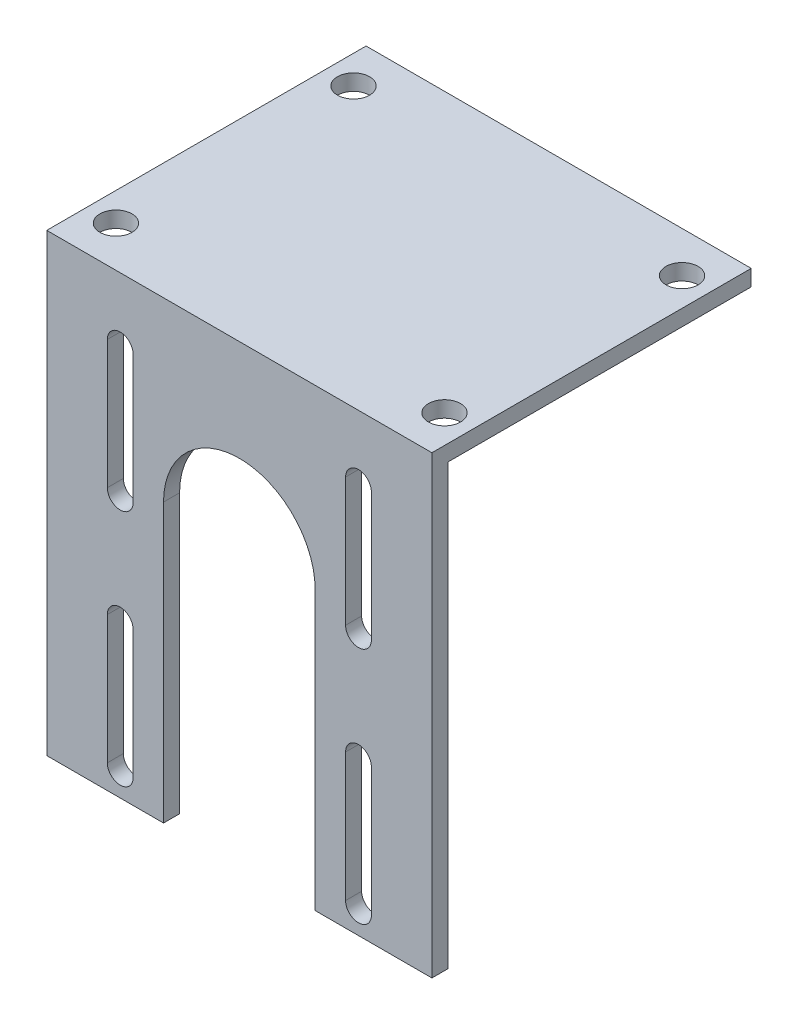
ISO-10303-21;
HEADER;
FILE_DESCRIPTION(('STEP AP214'),'2;1');
FILE_NAME('part.step','',(''),(''),'','','');
FILE_SCHEMA(('AUTOMOTIVE_DESIGN { 1 0 10303 214 1 1 1 1 }'));
ENDSEC;
DATA;
#1=APPLICATION_CONTEXT('core data for automotive mechanical design processes');
#2=APPLICATION_PROTOCOL_DEFINITION('international standard','automotive_design',2000,#1);
#3=PRODUCT_CONTEXT('',#1,'mechanical');
#4=PRODUCT('Part','Part','',(#3));
#5=PRODUCT_RELATED_PRODUCT_CATEGORY('part','',(#4));
#6=PRODUCT_DEFINITION_FORMATION('','',#4);
#7=PRODUCT_DEFINITION_CONTEXT('part definition',#1,'design');
#8=PRODUCT_DEFINITION('design','',#6,#7);
#9=PRODUCT_DEFINITION_SHAPE('','',#8);
#10=(LENGTH_UNIT() NAMED_UNIT(*) SI_UNIT(.MILLI.,.METRE.));
#11=(NAMED_UNIT(*) PLANE_ANGLE_UNIT() SI_UNIT($,.RADIAN.));
#12=(NAMED_UNIT(*) SI_UNIT($,.STERADIAN.) SOLID_ANGLE_UNIT());
#13=UNCERTAINTY_MEASURE_WITH_UNIT(LENGTH_MEASURE(1.E-05),#10,'distance_accuracy_value','');
#14=(GEOMETRIC_REPRESENTATION_CONTEXT(3) GLOBAL_UNCERTAINTY_ASSIGNED_CONTEXT((#13)) GLOBAL_UNIT_ASSIGNED_CONTEXT((#10,
#11,#12)) REPRESENTATION_CONTEXT('',''));
#15=CARTESIAN_POINT('',(0.,0.,0.));
#16=DIRECTION('',(0.,0.,1.));
#17=DIRECTION('',(1.,0.,0.));
#18=AXIS2_PLACEMENT_3D('',#15,#16,#17);
#19=CARTESIAN_POINT('',(0.,0.,3.175));
#20=DIRECTION('',(0.,0.,-1.));
#21=DIRECTION('',(-1.,0.,0.));
#22=AXIS2_PLACEMENT_3D('',#19,#20,#21);
#23=PLANE('',#22);
#24=CARTESIAN_POINT('',(14.53,-85.24,3.175));
#25=DIRECTION('',(0.,0.,1.));
#26=DIRECTION('',(-1.,0.,0.));
#27=AXIS2_PLACEMENT_3D('',#24,#25,#26);
#28=CIRCLE('',#27,2.54999999999998);
#29=CARTESIAN_POINT('',(11.98,-85.24,3.175));
#30=VERTEX_POINT('',#29);
#31=CARTESIAN_POINT('',(17.08,-85.24,3.175));
#32=VERTEX_POINT('',#31);
#33=EDGE_CURVE('E366',#30,#32,#28,.T.);
#34=ORIENTED_EDGE('',*,*,#33,.F.);
#35=DIRECTION('',(0.,-1.,0.));
#36=VECTOR('',#35,1.);
#37=CARTESIAN_POINT('',(11.98,-85.24,3.175));
#38=LINE('',#37,#36);
#39=CARTESIAN_POINT('',(11.98,-59.84,3.175));
#40=VERTEX_POINT('',#39);
#41=EDGE_CURVE('E377',#40,#30,#38,.T.);
#42=ORIENTED_EDGE('',*,*,#41,.F.);
#43=CARTESIAN_POINT('',(14.53,-59.84,3.175));
#44=DIRECTION('',(0.,0.,1.));
#45=DIRECTION('',(-1.,0.,0.));
#46=AXIS2_PLACEMENT_3D('',#43,#44,#45);
#47=CIRCLE('',#46,2.54999999999998);
#48=CARTESIAN_POINT('',(17.08,-59.84,3.175));
#49=VERTEX_POINT('',#48);
#50=EDGE_CURVE('E373',#49,#40,#47,.T.);
#51=ORIENTED_EDGE('',*,*,#50,.F.);
#52=DIRECTION('',(0.,1.,0.));
#53=VECTOR('',#52,1.);
#54=CARTESIAN_POINT('',(17.08,-85.24,3.175));
#55=LINE('',#54,#53);
#56=EDGE_CURVE('E369',#32,#49,#55,.T.);
#57=ORIENTED_EDGE('',*,*,#56,.F.);
#58=EDGE_LOOP('',(#34,#42,#51,#57));
#59=FACE_BOUND('',#58,.T.);
#60=CARTESIAN_POINT('',(14.53,-12.7,3.175));
#61=DIRECTION('',(0.,0.,1.));
#62=DIRECTION('',(1.,0.,0.));
#63=AXIS2_PLACEMENT_3D('',#60,#61,#62);
#64=CIRCLE('',#63,2.55000000000001);
#65=CARTESIAN_POINT('',(17.08,-12.7,3.175));
#66=VERTEX_POINT('',#65);
#67=CARTESIAN_POINT('',(11.98,-12.7,3.175));
#68=VERTEX_POINT('',#67);
#69=EDGE_CURVE('E452',#66,#68,#64,.T.);
#70=ORIENTED_EDGE('',*,*,#69,.F.);
#71=DIRECTION('',(0.,1.,0.));
#72=VECTOR('',#71,1.);
#73=CARTESIAN_POINT('',(17.08,-12.7,3.175));
#74=LINE('',#73,#72);
#75=CARTESIAN_POINT('',(17.08,-38.1,3.175));
#76=VERTEX_POINT('',#75);
#77=EDGE_CURVE('E463',#76,#66,#74,.T.);
#78=ORIENTED_EDGE('',*,*,#77,.F.);
#79=CARTESIAN_POINT('',(14.53,-38.1,3.175));
#80=DIRECTION('',(0.,0.,1.));
#81=DIRECTION('',(1.,0.,0.));
#82=AXIS2_PLACEMENT_3D('',#79,#80,#81);
#83=CIRCLE('',#82,2.55000000000001);
#84=CARTESIAN_POINT('',(11.98,-38.1,3.175));
#85=VERTEX_POINT('',#84);
#86=EDGE_CURVE('E459',#85,#76,#83,.T.);
#87=ORIENTED_EDGE('',*,*,#86,.F.);
#88=DIRECTION('',(0.,-1.,0.));
#89=VECTOR('',#88,1.);
#90=CARTESIAN_POINT('',(11.98,-12.7,3.175));
#91=LINE('',#90,#89);
#92=EDGE_CURVE('E455',#68,#85,#91,.T.);
#93=ORIENTED_EDGE('',*,*,#92,.F.);
#94=EDGE_LOOP('',(#70,#78,#87,#93));
#95=FACE_BOUND('',#94,.T.);
#96=DIRECTION('',(0.,-1.,0.));
#97=VECTOR('',#96,1.);
#98=CARTESIAN_POINT('',(0.,0.,3.175));
#99=LINE('',#98,#97);
#100=CARTESIAN_POINT('',(0.,0.,3.175));
#101=VERTEX_POINT('',#100);
#102=CARTESIAN_POINT('',(0.,-90.,3.175));
#103=VERTEX_POINT('',#102);
#104=EDGE_CURVE('E239',#101,#103,#99,.T.);
#105=ORIENTED_EDGE('',*,*,#104,.T.);
#106=DIRECTION('',(-1.,0.,0.));
#107=VECTOR('',#106,1.);
#108=CARTESIAN_POINT('',(0.,-90.,3.175));
#109=LINE('',#108,#107);
#110=CARTESIAN_POINT('',(23.1,-90.,3.175));
#111=VERTEX_POINT('',#110);
#112=EDGE_CURVE('E229',#111,#103,#109,.T.);
#113=ORIENTED_EDGE('',*,*,#112,.F.);
#114=DIRECTION('',(0.,-1.,0.));
#115=VECTOR('',#114,1.);
#116=CARTESIAN_POINT('',(23.1,-35.0000000000001,3.175));
#117=LINE('',#116,#115);
#118=CARTESIAN_POINT('',(23.1,-35.0000000000001,3.175));
#119=VERTEX_POINT('',#118);
#120=EDGE_CURVE('E305',#119,#111,#117,.T.);
#121=ORIENTED_EDGE('',*,*,#120,.F.);
#122=CARTESIAN_POINT('',(38.1,-35.0000000000001,3.175));
#123=DIRECTION('',(0.,0.,1.));
#124=DIRECTION('',(-1.,0.,0.));
#125=AXIS2_PLACEMENT_3D('',#122,#123,#124);
#126=CIRCLE('',#125,15.);
#127=CARTESIAN_POINT('',(53.1,-35.0000000000001,3.175));
#128=VERTEX_POINT('',#127);
#129=EDGE_CURVE('E301',#128,#119,#126,.T.);
#130=ORIENTED_EDGE('',*,*,#129,.F.);
#131=DIRECTION('',(0.,1.,0.));
#132=VECTOR('',#131,1.);
#133=CARTESIAN_POINT('',(53.1,-35.0000000000001,3.175));
#134=LINE('',#133,#132);
#135=CARTESIAN_POINT('',(53.1,-90.,3.175));
#136=VERTEX_POINT('',#135);
#137=EDGE_CURVE('E227',#136,#128,#134,.T.);
#138=ORIENTED_EDGE('',*,*,#137,.F.);
#139=CARTESIAN_POINT('',(76.2,-90.,3.175));
#140=VERTEX_POINT('',#139);
#141=EDGE_CURVE('E55',#140,#136,#109,.T.);
#142=ORIENTED_EDGE('',*,*,#141,.F.);
#143=DIRECTION('',(0.,1.,0.));
#144=VECTOR('',#143,1.);
#145=CARTESIAN_POINT('',(76.2,-100.,3.175));
#146=LINE('',#145,#144);
#147=CARTESIAN_POINT('',(76.2,0.,3.175));
#148=VERTEX_POINT('',#147);
#149=EDGE_CURVE('E224',#140,#148,#146,.T.);
#150=ORIENTED_EDGE('',*,*,#149,.T.);
#151=DIRECTION('',(-1.,0.,0.));
#152=VECTOR('',#151,1.);
#153=CARTESIAN_POINT('',(0.,0.,3.175));
#154=LINE('',#153,#152);
#155=EDGE_CURVE('E234',#148,#101,#154,.T.);
#156=ORIENTED_EDGE('',*,*,#155,.T.);
#157=EDGE_LOOP('',(#105,#113,#121,#130,#138,#142,#150,#156));
#158=FACE_BOUND('',#157,.T.);
#159=CARTESIAN_POINT('',(61.67,-12.7,3.175));
#160=DIRECTION('',(0.,0.,1.));
#161=DIRECTION('',(-1.,0.,0.));
#162=AXIS2_PLACEMENT_3D('',#159,#160,#161);
#163=CIRCLE('',#162,2.55000000000001);
#164=CARTESIAN_POINT('',(64.22,-12.7,3.175));
#165=VERTEX_POINT('',#164);
#166=CARTESIAN_POINT('',(59.12,-12.7,3.175));
#167=VERTEX_POINT('',#166);
#168=EDGE_CURVE('E409',#165,#167,#163,.T.);
#169=ORIENTED_EDGE('',*,*,#168,.F.);
#170=DIRECTION('',(0.,1.,0.));
#171=VECTOR('',#170,1.);
#172=CARTESIAN_POINT('',(64.22,-12.7,3.175));
#173=LINE('',#172,#171);
#174=CARTESIAN_POINT('',(64.22,-38.1,3.175));
#175=VERTEX_POINT('',#174);
#176=EDGE_CURVE('E420',#175,#165,#173,.T.);
#177=ORIENTED_EDGE('',*,*,#176,.F.);
#178=CARTESIAN_POINT('',(61.67,-38.1,3.175));
#179=DIRECTION('',(0.,0.,1.));
#180=DIRECTION('',(-1.,0.,0.));
#181=AXIS2_PLACEMENT_3D('',#178,#179,#180);
#182=CIRCLE('',#181,2.55000000000001);
#183=CARTESIAN_POINT('',(59.12,-38.1,3.175));
#184=VERTEX_POINT('',#183);
#185=EDGE_CURVE('E416',#184,#175,#182,.T.);
#186=ORIENTED_EDGE('',*,*,#185,.F.);
#187=DIRECTION('',(0.,-1.,0.));
#188=VECTOR('',#187,1.);
#189=CARTESIAN_POINT('',(59.12,-12.7,3.175));
#190=LINE('',#189,#188);
#191=EDGE_CURVE('E412',#167,#184,#190,.T.);
#192=ORIENTED_EDGE('',*,*,#191,.F.);
#193=EDGE_LOOP('',(#169,#177,#186,#192));
#194=FACE_BOUND('',#193,.T.);
#195=CARTESIAN_POINT('',(61.67,-85.265,3.175));
#196=DIRECTION('',(0.,0.,1.));
#197=DIRECTION('',(1.,0.,0.));
#198=AXIS2_PLACEMENT_3D('',#195,#196,#197);
#199=CIRCLE('',#198,2.54999999999998);
#200=CARTESIAN_POINT('',(59.12,-85.265,3.175));
#201=VERTEX_POINT('',#200);
#202=CARTESIAN_POINT('',(64.22,-85.265,3.175));
#203=VERTEX_POINT('',#202);
#204=EDGE_CURVE('E323',#201,#203,#199,.T.);
#205=ORIENTED_EDGE('',*,*,#204,.F.);
#206=DIRECTION('',(0.,-1.,0.));
#207=VECTOR('',#206,1.);
#208=CARTESIAN_POINT('',(59.12,-85.265,3.175));
#209=LINE('',#208,#207);
#210=CARTESIAN_POINT('',(59.12,-59.815,3.175));
#211=VERTEX_POINT('',#210);
#212=EDGE_CURVE('E334',#211,#201,#209,.T.);
#213=ORIENTED_EDGE('',*,*,#212,.F.);
#214=CARTESIAN_POINT('',(61.67,-59.815,3.175));
#215=DIRECTION('',(0.,0.,1.));
#216=DIRECTION('',(1.,0.,0.));
#217=AXIS2_PLACEMENT_3D('',#214,#215,#216);
#218=CIRCLE('',#217,2.54999999999998);
#219=CARTESIAN_POINT('',(64.22,-59.815,3.175));
#220=VERTEX_POINT('',#219);
#221=EDGE_CURVE('E330',#220,#211,#218,.T.);
#222=ORIENTED_EDGE('',*,*,#221,.F.);
#223=DIRECTION('',(0.,1.,0.));
#224=VECTOR('',#223,1.);
#225=CARTESIAN_POINT('',(64.22,-85.265,3.175));
#226=LINE('',#225,#224);
#227=EDGE_CURVE('E326',#203,#220,#226,.T.);
#228=ORIENTED_EDGE('',*,*,#227,.F.);
#229=EDGE_LOOP('',(#205,#213,#222,#228));
#230=FACE_BOUND('',#229,.T.);
#231=ADVANCED_FACE('F39',(#59,#95,#158,#194,#230),#23,.F.);
#232=CARTESIAN_POINT('',(0.,0.,0.));
#233=DIRECTION('',(0.,0.,-1.));
#234=DIRECTION('',(-1.,0.,0.));
#235=AXIS2_PLACEMENT_3D('',#232,#233,#234);
#236=PLANE('',#235);
#237=DIRECTION('',(1.,0.,0.));
#238=VECTOR('',#237,1.);
#239=CARTESIAN_POINT('',(0.,-90.,0.));
#240=LINE('',#239,#238);
#241=CARTESIAN_POINT('',(0.,-90.,0.));
#242=VERTEX_POINT('',#241);
#243=CARTESIAN_POINT('',(23.1,-90.,0.));
#244=VERTEX_POINT('',#243);
#245=EDGE_CURVE('E63',#242,#244,#240,.T.);
#246=ORIENTED_EDGE('',*,*,#245,.F.);
#247=DIRECTION('',(0.,-1.,0.));
#248=VECTOR('',#247,1.);
#249=CARTESIAN_POINT('',(0.,0.,0.));
#250=LINE('',#249,#248);
#251=CARTESIAN_POINT('',(0.,-3.175,0.));
#252=VERTEX_POINT('',#251);
#253=EDGE_CURVE('E235',#252,#242,#250,.T.);
#254=ORIENTED_EDGE('',*,*,#253,.F.);
#255=DIRECTION('',(-1.,0.,0.));
#256=VECTOR('',#255,1.);
#257=CARTESIAN_POINT('',(76.2,-3.175,0.));
#258=LINE('',#257,#256);
#259=CARTESIAN_POINT('',(76.2,-3.175,0.));
#260=VERTEX_POINT('',#259);
#261=EDGE_CURVE('E276',#260,#252,#258,.T.);
#262=ORIENTED_EDGE('',*,*,#261,.F.);
#263=DIRECTION('',(0.,1.,0.));
#264=VECTOR('',#263,1.);
#265=CARTESIAN_POINT('',(76.2,-100.,0.));
#266=LINE('',#265,#264);
#267=CARTESIAN_POINT('',(76.2,-90.,0.));
#268=VERTEX_POINT('',#267);
#269=EDGE_CURVE('E242',#268,#260,#266,.T.);
#270=ORIENTED_EDGE('',*,*,#269,.F.);
#271=CARTESIAN_POINT('',(53.1,-90.,0.));
#272=VERTEX_POINT('',#271);
#273=EDGE_CURVE('E213',#272,#268,#240,.T.);
#274=ORIENTED_EDGE('',*,*,#273,.F.);
#275=DIRECTION('',(0.,1.,0.));
#276=VECTOR('',#275,1.);
#277=CARTESIAN_POINT('',(53.1,-35.0000000000001,0.));
#278=LINE('',#277,#276);
#279=CARTESIAN_POINT('',(53.1,-35.0000000000001,0.));
#280=VERTEX_POINT('',#279);
#281=EDGE_CURVE('E298',#272,#280,#278,.T.);
#282=ORIENTED_EDGE('',*,*,#281,.T.);
#283=CARTESIAN_POINT('',(38.1,-35.0000000000001,0.));
#284=DIRECTION('',(0.,0.,-1.));
#285=DIRECTION('',(-1.,0.,0.));
#286=AXIS2_PLACEMENT_3D('',#283,#284,#285);
#287=CIRCLE('',#286,15.);
#288=CARTESIAN_POINT('',(23.1,-35.0000000000001,0.));
#289=VERTEX_POINT('',#288);
#290=EDGE_CURVE('E294',#280,#289,#287,.F.);
#291=ORIENTED_EDGE('',*,*,#290,.T.);
#292=DIRECTION('',(0.,-1.,0.));
#293=VECTOR('',#292,1.);
#294=CARTESIAN_POINT('',(23.1,-35.0000000000001,0.));
#295=LINE('',#294,#293);
#296=EDGE_CURVE('E316',#289,#244,#295,.T.);
#297=ORIENTED_EDGE('',*,*,#296,.T.);
#298=EDGE_LOOP('',(#246,#254,#262,#270,#274,#282,#291,#297));
#299=FACE_BOUND('',#298,.T.);
#300=DIRECTION('',(0.,1.,0.));
#301=VECTOR('',#300,1.);
#302=CARTESIAN_POINT('',(17.08,-12.7,0.));
#303=LINE('',#302,#301);
#304=CARTESIAN_POINT('',(17.08,-38.1,0.));
#305=VERTEX_POINT('',#304);
#306=CARTESIAN_POINT('',(17.08,-12.7,0.));
#307=VERTEX_POINT('',#306);
#308=EDGE_CURVE('E456',#305,#307,#303,.T.);
#309=ORIENTED_EDGE('',*,*,#308,.T.);
#310=CARTESIAN_POINT('',(14.53,-12.7,0.));
#311=DIRECTION('',(0.,0.,1.));
#312=DIRECTION('',(1.,0.,0.));
#313=AXIS2_PLACEMENT_3D('',#310,#311,#312);
#314=CIRCLE('',#313,2.55000000000001);
#315=CARTESIAN_POINT('',(11.98,-12.7,0.));
#316=VERTEX_POINT('',#315);
#317=EDGE_CURVE('E451',#307,#316,#314,.T.);
#318=ORIENTED_EDGE('',*,*,#317,.T.);
#319=DIRECTION('',(0.,-1.,0.));
#320=VECTOR('',#319,1.);
#321=CARTESIAN_POINT('',(11.98,-12.7,0.));
#322=LINE('',#321,#320);
#323=CARTESIAN_POINT('',(11.98,-38.1,0.));
#324=VERTEX_POINT('',#323);
#325=EDGE_CURVE('E470',#316,#324,#322,.T.);
#326=ORIENTED_EDGE('',*,*,#325,.T.);
#327=CARTESIAN_POINT('',(14.53,-38.1,0.));
#328=DIRECTION('',(0.,0.,1.));
#329=DIRECTION('',(1.,0.,0.));
#330=AXIS2_PLACEMENT_3D('',#327,#328,#329);
#331=CIRCLE('',#330,2.55000000000001);
#332=EDGE_CURVE('E474',#324,#305,#331,.T.);
#333=ORIENTED_EDGE('',*,*,#332,.T.);
#334=EDGE_LOOP('',(#309,#318,#326,#333));
#335=FACE_BOUND('',#334,.T.);
#336=DIRECTION('',(0.,1.,0.));
#337=VECTOR('',#336,1.);
#338=CARTESIAN_POINT('',(64.22,-12.7,0.));
#339=LINE('',#338,#337);
#340=CARTESIAN_POINT('',(64.22,-38.1,0.));
#341=VERTEX_POINT('',#340);
#342=CARTESIAN_POINT('',(64.22,-12.7,0.));
#343=VERTEX_POINT('',#342);
#344=EDGE_CURVE('E413',#341,#343,#339,.T.);
#345=ORIENTED_EDGE('',*,*,#344,.T.);
#346=CARTESIAN_POINT('',(61.67,-12.7,0.));
#347=DIRECTION('',(0.,0.,1.));
#348=DIRECTION('',(-1.,0.,0.));
#349=AXIS2_PLACEMENT_3D('',#346,#347,#348);
#350=CIRCLE('',#349,2.55000000000001);
#351=CARTESIAN_POINT('',(59.12,-12.7,0.));
#352=VERTEX_POINT('',#351);
#353=EDGE_CURVE('E408',#343,#352,#350,.T.);
#354=ORIENTED_EDGE('',*,*,#353,.T.);
#355=DIRECTION('',(0.,-1.,0.));
#356=VECTOR('',#355,1.);
#357=CARTESIAN_POINT('',(59.12,-12.7,0.));
#358=LINE('',#357,#356);
#359=CARTESIAN_POINT('',(59.12,-38.1,0.));
#360=VERTEX_POINT('',#359);
#361=EDGE_CURVE('E427',#352,#360,#358,.T.);
#362=ORIENTED_EDGE('',*,*,#361,.T.);
#363=CARTESIAN_POINT('',(61.67,-38.1,0.));
#364=DIRECTION('',(0.,0.,1.));
#365=DIRECTION('',(-1.,0.,0.));
#366=AXIS2_PLACEMENT_3D('',#363,#364,#365);
#367=CIRCLE('',#366,2.55000000000001);
#368=EDGE_CURVE('E431',#360,#341,#367,.T.);
#369=ORIENTED_EDGE('',*,*,#368,.T.);
#370=EDGE_LOOP('',(#345,#354,#362,#369));
#371=FACE_BOUND('',#370,.T.);
#372=DIRECTION('',(0.,-1.,0.));
#373=VECTOR('',#372,1.);
#374=CARTESIAN_POINT('',(11.98,-85.24,0.));
#375=LINE('',#374,#373);
#376=CARTESIAN_POINT('',(11.98,-59.84,0.));
#377=VERTEX_POINT('',#376);
#378=CARTESIAN_POINT('',(11.98,-85.24,0.));
#379=VERTEX_POINT('',#378);
#380=EDGE_CURVE('E370',#377,#379,#375,.T.);
#381=ORIENTED_EDGE('',*,*,#380,.T.);
#382=CARTESIAN_POINT('',(14.53,-85.24,0.));
#383=DIRECTION('',(0.,0.,1.));
#384=DIRECTION('',(-1.,0.,0.));
#385=AXIS2_PLACEMENT_3D('',#382,#383,#384);
#386=CIRCLE('',#385,2.54999999999998);
#387=CARTESIAN_POINT('',(17.08,-85.24,0.));
#388=VERTEX_POINT('',#387);
#389=EDGE_CURVE('E365',#379,#388,#386,.T.);
#390=ORIENTED_EDGE('',*,*,#389,.T.);
#391=DIRECTION('',(0.,1.,0.));
#392=VECTOR('',#391,1.);
#393=CARTESIAN_POINT('',(17.08,-85.24,0.));
#394=LINE('',#393,#392);
#395=CARTESIAN_POINT('',(17.08,-59.84,0.));
#396=VERTEX_POINT('',#395);
#397=EDGE_CURVE('E384',#388,#396,#394,.T.);
#398=ORIENTED_EDGE('',*,*,#397,.T.);
#399=CARTESIAN_POINT('',(14.53,-59.84,0.));
#400=DIRECTION('',(0.,0.,1.));
#401=DIRECTION('',(-1.,0.,0.));
#402=AXIS2_PLACEMENT_3D('',#399,#400,#401);
#403=CIRCLE('',#402,2.54999999999998);
#404=EDGE_CURVE('E388',#396,#377,#403,.T.);
#405=ORIENTED_EDGE('',*,*,#404,.T.);
#406=EDGE_LOOP('',(#381,#390,#398,#405));
#407=FACE_BOUND('',#406,.T.);
#408=DIRECTION('',(0.,-1.,0.));
#409=VECTOR('',#408,1.);
#410=CARTESIAN_POINT('',(59.12,-85.265,0.));
#411=LINE('',#410,#409);
#412=CARTESIAN_POINT('',(59.12,-59.815,0.));
#413=VERTEX_POINT('',#412);
#414=CARTESIAN_POINT('',(59.12,-85.265,0.));
#415=VERTEX_POINT('',#414);
#416=EDGE_CURVE('E327',#413,#415,#411,.T.);
#417=ORIENTED_EDGE('',*,*,#416,.T.);
#418=CARTESIAN_POINT('',(61.67,-85.265,0.));
#419=DIRECTION('',(0.,0.,1.));
#420=DIRECTION('',(1.,0.,0.));
#421=AXIS2_PLACEMENT_3D('',#418,#419,#420);
#422=CIRCLE('',#421,2.54999999999998);
#423=CARTESIAN_POINT('',(64.22,-85.265,0.));
#424=VERTEX_POINT('',#423);
#425=EDGE_CURVE('E322',#415,#424,#422,.T.);
#426=ORIENTED_EDGE('',*,*,#425,.T.);
#427=DIRECTION('',(0.,1.,0.));
#428=VECTOR('',#427,1.);
#429=CARTESIAN_POINT('',(64.22,-85.265,0.));
#430=LINE('',#429,#428);
#431=CARTESIAN_POINT('',(64.22,-59.815,0.));
#432=VERTEX_POINT('',#431);
#433=EDGE_CURVE('E341',#424,#432,#430,.T.);
#434=ORIENTED_EDGE('',*,*,#433,.T.);
#435=CARTESIAN_POINT('',(61.67,-59.815,0.));
#436=DIRECTION('',(0.,0.,1.));
#437=DIRECTION('',(1.,0.,0.));
#438=AXIS2_PLACEMENT_3D('',#435,#436,#437);
#439=CIRCLE('',#438,2.54999999999998);
#440=EDGE_CURVE('E345',#432,#413,#439,.T.);
#441=ORIENTED_EDGE('',*,*,#440,.T.);
#442=EDGE_LOOP('',(#417,#426,#434,#441));
#443=FACE_BOUND('',#442,.T.);
#444=ADVANCED_FACE('F500',(#299,#335,#371,#407,#443),#236,.T.);
#445=CARTESIAN_POINT('',(76.2,-100.,3.175));
#446=DIRECTION('',(-1.,0.,0.));
#447=DIRECTION('',(0.,-1.,0.));
#448=AXIS2_PLACEMENT_3D('',#445,#446,#447);
#449=PLANE('',#448);
#450=ORIENTED_EDGE('',*,*,#149,.F.);
#451=DIRECTION('',(0.,0.,1.));
#452=VECTOR('',#451,1.);
#453=CARTESIAN_POINT('',(76.2,-90.,-60.));
#454=LINE('',#453,#452);
#455=EDGE_CURVE('E210',#268,#140,#454,.T.);
#456=ORIENTED_EDGE('',*,*,#455,.F.);
#457=ORIENTED_EDGE('',*,*,#269,.T.);
#458=DIRECTION('',(0.,0.,1.));
#459=VECTOR('',#458,1.);
#460=CARTESIAN_POINT('',(76.2,-3.175,-60.));
#461=LINE('',#460,#459);
#462=CARTESIAN_POINT('',(76.2,-3.175,-60.));
#463=VERTEX_POINT('',#462);
#464=EDGE_CURVE('E273',#463,#260,#461,.T.);
#465=ORIENTED_EDGE('',*,*,#464,.F.);
#466=DIRECTION('',(0.,-1.,0.));
#467=VECTOR('',#466,1.);
#468=CARTESIAN_POINT('',(76.2,0.,-60.));
#469=LINE('',#468,#467);
#470=CARTESIAN_POINT('',(76.2,0.,-60.));
#471=VERTEX_POINT('',#470);
#472=EDGE_CURVE('E265',#471,#463,#469,.T.);
#473=ORIENTED_EDGE('',*,*,#472,.F.);
#474=DIRECTION('',(0.,0.,-1.));
#475=VECTOR('',#474,1.);
#476=CARTESIAN_POINT('',(76.2,0.,3.175));
#477=LINE('',#476,#475);
#478=EDGE_CURVE('E48',#148,#471,#477,.T.);
#479=ORIENTED_EDGE('',*,*,#478,.F.);
#480=EDGE_LOOP('',(#450,#456,#457,#465,#473,#479));
#481=FACE_BOUND('',#480,.T.);
#482=ADVANCED_FACE('F41',(#481),#449,.F.);
#483=CARTESIAN_POINT('',(0.,0.,3.175));
#484=DIRECTION('',(0.,-1.,0.));
#485=DIRECTION('',(1.,0.,0.));
#486=AXIS2_PLACEMENT_3D('',#483,#484,#485);
#487=PLANE('',#486);
#488=CARTESIAN_POINT('',(5.6,0.,-4.9125));
#489=DIRECTION('',(0.,1.,0.));
#490=DIRECTION('',(-1.,0.,0.));
#491=AXIS2_PLACEMENT_3D('',#488,#489,#490);
#492=CIRCLE('',#491,3.175);
#493=CARTESIAN_POINT('',(2.425,0.,-4.9125));
#494=VERTEX_POINT('',#493);
#495=EDGE_CURVE('E542',#494,#494,#492,.T.);
#496=ORIENTED_EDGE('',*,*,#495,.F.);
#497=EDGE_LOOP('',(#496));
#498=FACE_BOUND('',#497,.T.);
#499=CARTESIAN_POINT('',(70.6,0.,-51.9125));
#500=DIRECTION('',(0.,1.,0.));
#501=DIRECTION('',(-1.,0.,0.));
#502=AXIS2_PLACEMENT_3D('',#499,#500,#501);
#503=CIRCLE('',#502,3.175);
#504=CARTESIAN_POINT('',(67.425,0.,-51.9125));
#505=VERTEX_POINT('',#504);
#506=EDGE_CURVE('E546',#505,#505,#503,.T.);
#507=ORIENTED_EDGE('',*,*,#506,.F.);
#508=EDGE_LOOP('',(#507));
#509=FACE_BOUND('',#508,.T.);
#510=CARTESIAN_POINT('',(70.6,0.,-4.9125));
#511=DIRECTION('',(0.,1.,0.));
#512=DIRECTION('',(-1.,0.,0.));
#513=AXIS2_PLACEMENT_3D('',#510,#511,#512);
#514=CIRCLE('',#513,3.175);
#515=CARTESIAN_POINT('',(67.425,0.,-4.9125));
#516=VERTEX_POINT('',#515);
#517=EDGE_CURVE('E550',#516,#516,#514,.T.);
#518=ORIENTED_EDGE('',*,*,#517,.F.);
#519=EDGE_LOOP('',(#518));
#520=FACE_BOUND('',#519,.T.);
#521=CARTESIAN_POINT('',(5.6,0.,-51.9125));
#522=DIRECTION('',(0.,1.,0.));
#523=DIRECTION('',(-1.,0.,0.));
#524=AXIS2_PLACEMENT_3D('',#521,#522,#523);
#525=CIRCLE('',#524,3.175);
#526=CARTESIAN_POINT('',(2.425,0.,-51.9125));
#527=VERTEX_POINT('',#526);
#528=EDGE_CURVE('E553',#527,#527,#525,.T.);
#529=ORIENTED_EDGE('',*,*,#528,.F.);
#530=EDGE_LOOP('',(#529));
#531=FACE_BOUND('',#530,.T.);
#532=ORIENTED_EDGE('',*,*,#478,.T.);
#533=DIRECTION('',(1.,0.,0.));
#534=VECTOR('',#533,1.);
#535=CARTESIAN_POINT('',(76.2,0.,-60.));
#536=LINE('',#535,#534);
#537=CARTESIAN_POINT('',(0.,0.,-60.));
#538=VERTEX_POINT('',#537);
#539=EDGE_CURVE('E260',#538,#471,#536,.T.);
#540=ORIENTED_EDGE('',*,*,#539,.F.);
#541=DIRECTION('',(0.,0.,-1.));
#542=VECTOR('',#541,1.);
#543=CARTESIAN_POINT('',(0.,0.,3.175));
#544=LINE('',#543,#542);
#545=EDGE_CURVE('E250',#101,#538,#544,.T.);
#546=ORIENTED_EDGE('',*,*,#545,.F.);
#547=ORIENTED_EDGE('',*,*,#155,.F.);
#548=EDGE_LOOP('',(#532,#540,#546,#547));
#549=FACE_BOUND('',#548,.T.);
#550=ADVANCED_FACE('F258',(#498,#509,#520,#531,#549),#487,.F.);
#551=CARTESIAN_POINT('',(0.,0.,3.175));
#552=DIRECTION('',(1.,0.,0.));
#553=DIRECTION('',(0.,1.,0.));
#554=AXIS2_PLACEMENT_3D('',#551,#552,#553);
#555=PLANE('',#554);
#556=ORIENTED_EDGE('',*,*,#253,.T.);
#557=DIRECTION('',(0.,0.,1.));
#558=VECTOR('',#557,1.);
#559=CARTESIAN_POINT('',(0.,-90.,-60.));
#560=LINE('',#559,#558);
#561=EDGE_CURVE('E218',#242,#103,#560,.T.);
#562=ORIENTED_EDGE('',*,*,#561,.T.);
#563=ORIENTED_EDGE('',*,*,#104,.F.);
#564=ORIENTED_EDGE('',*,*,#545,.T.);
#565=DIRECTION('',(0.,1.,0.));
#566=VECTOR('',#565,1.);
#567=CARTESIAN_POINT('',(0.,0.,-60.));
#568=LINE('',#567,#566);
#569=CARTESIAN_POINT('',(0.,-3.175,-60.));
#570=VERTEX_POINT('',#569);
#571=EDGE_CURVE('E268',#570,#538,#568,.T.);
#572=ORIENTED_EDGE('',*,*,#571,.F.);
#573=DIRECTION('',(0.,0.,1.));
#574=VECTOR('',#573,1.);
#575=CARTESIAN_POINT('',(0.,-3.175,-60.));
#576=LINE('',#575,#574);
#577=EDGE_CURVE('E270',#570,#252,#576,.T.);
#578=ORIENTED_EDGE('',*,*,#577,.T.);
#579=EDGE_LOOP('',(#556,#562,#563,#564,#572,#578));
#580=FACE_BOUND('',#579,.T.);
#581=ADVANCED_FACE('F531',(#580),#555,.F.);
#582=CARTESIAN_POINT('',(14.53,-12.7,3.175));
#583=DIRECTION('',(0.,0.,-1.));
#584=DIRECTION('',(-1.,0.,0.));
#585=AXIS2_PLACEMENT_3D('',#582,#583,#584);
#586=CYLINDRICAL_SURFACE('',#585,2.55000000000001);
#587=ORIENTED_EDGE('',*,*,#317,.F.);
#588=DIRECTION('',(0.,0.,-1.));
#589=VECTOR('',#588,1.);
#590=CARTESIAN_POINT('',(17.08,-12.7,3.175));
#591=LINE('',#590,#589);
#592=EDGE_CURVE('E466',#66,#307,#591,.T.);
#593=ORIENTED_EDGE('',*,*,#592,.F.);
#594=ORIENTED_EDGE('',*,*,#69,.T.);
#595=DIRECTION('',(0.,0.,-1.));
#596=VECTOR('',#595,1.);
#597=CARTESIAN_POINT('',(11.98,-12.7,3.175));
#598=LINE('',#597,#596);
#599=EDGE_CURVE('E245',#68,#316,#598,.T.);
#600=ORIENTED_EDGE('',*,*,#599,.T.);
#601=EDGE_LOOP('',(#587,#593,#594,#600));
#602=FACE_BOUND('',#601,.T.);
#603=ADVANCED_FACE('F495',(#602),#586,.F.);
#604=CARTESIAN_POINT('',(11.98,-12.7,3.175));
#605=DIRECTION('',(1.,0.,0.));
#606=DIRECTION('',(0.,0.,-1.));
#607=AXIS2_PLACEMENT_3D('',#604,#605,#606);
#608=PLANE('',#607);
#609=ORIENTED_EDGE('',*,*,#325,.F.);
#610=ORIENTED_EDGE('',*,*,#599,.F.);
#611=ORIENTED_EDGE('',*,*,#92,.T.);
#612=DIRECTION('',(0.,0.,-1.));
#613=VECTOR('',#612,1.);
#614=CARTESIAN_POINT('',(11.98,-38.1,3.175));
#615=LINE('',#614,#613);
#616=EDGE_CURVE('E486',#85,#324,#615,.T.);
#617=ORIENTED_EDGE('',*,*,#616,.T.);
#618=EDGE_LOOP('',(#609,#610,#611,#617));
#619=FACE_BOUND('',#618,.T.);
#620=ADVANCED_FACE('F508',(#619),#608,.T.);
#621=CARTESIAN_POINT('',(14.53,-38.1,3.175));
#622=DIRECTION('',(0.,0.,-1.));
#623=DIRECTION('',(-1.,0.,0.));
#624=AXIS2_PLACEMENT_3D('',#621,#622,#623);
#625=CYLINDRICAL_SURFACE('',#624,2.55000000000001);
#626=ORIENTED_EDGE('',*,*,#332,.F.);
#627=ORIENTED_EDGE('',*,*,#616,.F.);
#628=ORIENTED_EDGE('',*,*,#86,.T.);
#629=DIRECTION('',(0.,0.,-1.));
#630=VECTOR('',#629,1.);
#631=CARTESIAN_POINT('',(17.08,-38.1,3.175));
#632=LINE('',#631,#630);
#633=EDGE_CURVE('E484',#76,#305,#632,.T.);
#634=ORIENTED_EDGE('',*,*,#633,.T.);
#635=EDGE_LOOP('',(#626,#627,#628,#634));
#636=FACE_BOUND('',#635,.T.);
#637=ADVANCED_FACE('F510',(#636),#625,.F.);
#638=CARTESIAN_POINT('',(17.08,-12.7,3.175));
#639=DIRECTION('',(-1.,0.,0.));
#640=DIRECTION('',(0.,0.,1.));
#641=AXIS2_PLACEMENT_3D('',#638,#639,#640);
#642=PLANE('',#641);
#643=ORIENTED_EDGE('',*,*,#308,.F.);
#644=ORIENTED_EDGE('',*,*,#633,.F.);
#645=ORIENTED_EDGE('',*,*,#77,.T.);
#646=ORIENTED_EDGE('',*,*,#592,.T.);
#647=EDGE_LOOP('',(#643,#644,#645,#646));
#648=FACE_BOUND('',#647,.T.);
#649=ADVANCED_FACE('F504',(#648),#642,.T.);
#650=CARTESIAN_POINT('',(61.67,-12.7,3.175));
#651=DIRECTION('',(0.,0.,-1.));
#652=DIRECTION('',(-1.,0.,0.));
#653=AXIS2_PLACEMENT_3D('',#650,#651,#652);
#654=CYLINDRICAL_SURFACE('',#653,2.55000000000001);
#655=ORIENTED_EDGE('',*,*,#353,.F.);
#656=DIRECTION('',(0.,0.,-1.));
#657=VECTOR('',#656,1.);
#658=CARTESIAN_POINT('',(64.22,-12.7,3.175));
#659=LINE('',#658,#657);
#660=EDGE_CURVE('E423',#165,#343,#659,.T.);
#661=ORIENTED_EDGE('',*,*,#660,.F.);
#662=ORIENTED_EDGE('',*,*,#168,.T.);
#663=DIRECTION('',(0.,0.,-1.));
#664=VECTOR('',#663,1.);
#665=CARTESIAN_POINT('',(59.12,-12.7,3.175));
#666=LINE('',#665,#664);
#667=EDGE_CURVE('E447',#167,#352,#666,.T.);
#668=ORIENTED_EDGE('',*,*,#667,.T.);
#669=EDGE_LOOP('',(#655,#661,#662,#668));
#670=FACE_BOUND('',#669,.T.);
#671=ADVANCED_FACE('F517',(#670),#654,.F.);
#672=CARTESIAN_POINT('',(59.12,-12.7,3.175));
#673=DIRECTION('',(1.,0.,0.));
#674=DIRECTION('',(0.,0.,-1.));
#675=AXIS2_PLACEMENT_3D('',#672,#673,#674);
#676=PLANE('',#675);
#677=ORIENTED_EDGE('',*,*,#361,.F.);
#678=ORIENTED_EDGE('',*,*,#667,.F.);
#679=ORIENTED_EDGE('',*,*,#191,.T.);
#680=DIRECTION('',(0.,0.,-1.));
#681=VECTOR('',#680,1.);
#682=CARTESIAN_POINT('',(59.12,-38.1,3.175));
#683=LINE('',#682,#681);
#684=EDGE_CURVE('E444',#184,#360,#683,.T.);
#685=ORIENTED_EDGE('',*,*,#684,.T.);
#686=EDGE_LOOP('',(#677,#678,#679,#685));
#687=FACE_BOUND('',#686,.T.);
#688=ADVANCED_FACE('F652',(#687),#676,.T.);
#689=CARTESIAN_POINT('',(61.67,-38.1,3.175));
#690=DIRECTION('',(0.,0.,-1.));
#691=DIRECTION('',(-1.,0.,0.));
#692=AXIS2_PLACEMENT_3D('',#689,#690,#691);
#693=CYLINDRICAL_SURFACE('',#692,2.55000000000001);
#694=ORIENTED_EDGE('',*,*,#368,.F.);
#695=ORIENTED_EDGE('',*,*,#684,.F.);
#696=ORIENTED_EDGE('',*,*,#185,.T.);
#697=DIRECTION('',(0.,0.,-1.));
#698=VECTOR('',#697,1.);
#699=CARTESIAN_POINT('',(64.22,-38.1,3.175));
#700=LINE('',#699,#698);
#701=EDGE_CURVE('E441',#175,#341,#700,.T.);
#702=ORIENTED_EDGE('',*,*,#701,.T.);
#703=EDGE_LOOP('',(#694,#695,#696,#702));
#704=FACE_BOUND('',#703,.T.);
#705=ADVANCED_FACE('F648',(#704),#693,.F.);
#706=CARTESIAN_POINT('',(64.22,-12.7,3.175));
#707=DIRECTION('',(-1.,0.,0.));
#708=DIRECTION('',(0.,0.,1.));
#709=AXIS2_PLACEMENT_3D('',#706,#707,#708);
#710=PLANE('',#709);
#711=ORIENTED_EDGE('',*,*,#344,.F.);
#712=ORIENTED_EDGE('',*,*,#701,.F.);
#713=ORIENTED_EDGE('',*,*,#176,.T.);
#714=ORIENTED_EDGE('',*,*,#660,.T.);
#715=EDGE_LOOP('',(#711,#712,#713,#714));
#716=FACE_BOUND('',#715,.T.);
#717=ADVANCED_FACE('F644',(#716),#710,.T.);
#718=CARTESIAN_POINT('',(14.53,-85.24,3.175));
#719=DIRECTION('',(0.,0.,-1.));
#720=DIRECTION('',(-1.,0.,0.));
#721=AXIS2_PLACEMENT_3D('',#718,#719,#720);
#722=CYLINDRICAL_SURFACE('',#721,2.54999999999998);
#723=ORIENTED_EDGE('',*,*,#389,.F.);
#724=DIRECTION('',(0.,0.,-1.));
#725=VECTOR('',#724,1.);
#726=CARTESIAN_POINT('',(11.98,-85.24,3.175));
#727=LINE('',#726,#725);
#728=EDGE_CURVE('E380',#30,#379,#727,.T.);
#729=ORIENTED_EDGE('',*,*,#728,.F.);
#730=ORIENTED_EDGE('',*,*,#33,.T.);
#731=DIRECTION('',(0.,0.,-1.));
#732=VECTOR('',#731,1.);
#733=CARTESIAN_POINT('',(17.08,-85.24,3.175));
#734=LINE('',#733,#732);
#735=EDGE_CURVE('E404',#32,#388,#734,.T.);
#736=ORIENTED_EDGE('',*,*,#735,.T.);
#737=EDGE_LOOP('',(#723,#729,#730,#736));
#738=FACE_BOUND('',#737,.T.);
#739=ADVANCED_FACE('F640',(#738),#722,.F.);
#740=CARTESIAN_POINT('',(17.08,-85.24,3.175));
#741=DIRECTION('',(-1.,0.,0.));
#742=DIRECTION('',(0.,0.,1.));
#743=AXIS2_PLACEMENT_3D('',#740,#741,#742);
#744=PLANE('',#743);
#745=ORIENTED_EDGE('',*,*,#397,.F.);
#746=ORIENTED_EDGE('',*,*,#735,.F.);
#747=ORIENTED_EDGE('',*,*,#56,.T.);
#748=DIRECTION('',(0.,0.,-1.));
#749=VECTOR('',#748,1.);
#750=CARTESIAN_POINT('',(17.08,-59.84,3.175));
#751=LINE('',#750,#749);
#752=EDGE_CURVE('E401',#49,#396,#751,.T.);
#753=ORIENTED_EDGE('',*,*,#752,.T.);
#754=EDGE_LOOP('',(#745,#746,#747,#753));
#755=FACE_BOUND('',#754,.T.);
#756=ADVANCED_FACE('F636',(#755),#744,.T.);
#757=CARTESIAN_POINT('',(14.53,-59.84,3.175));
#758=DIRECTION('',(0.,0.,-1.));
#759=DIRECTION('',(-1.,0.,0.));
#760=AXIS2_PLACEMENT_3D('',#757,#758,#759);
#761=CYLINDRICAL_SURFACE('',#760,2.54999999999998);
#762=ORIENTED_EDGE('',*,*,#404,.F.);
#763=ORIENTED_EDGE('',*,*,#752,.F.);
#764=ORIENTED_EDGE('',*,*,#50,.T.);
#765=DIRECTION('',(0.,0.,-1.));
#766=VECTOR('',#765,1.);
#767=CARTESIAN_POINT('',(11.98,-59.84,3.175));
#768=LINE('',#767,#766);
#769=EDGE_CURVE('E398',#40,#377,#768,.T.);
#770=ORIENTED_EDGE('',*,*,#769,.T.);
#771=EDGE_LOOP('',(#762,#763,#764,#770));
#772=FACE_BOUND('',#771,.T.);
#773=ADVANCED_FACE('F632',(#772),#761,.F.);
#774=CARTESIAN_POINT('',(11.98,-85.24,3.175));
#775=DIRECTION('',(1.,0.,0.));
#776=DIRECTION('',(0.,0.,-1.));
#777=AXIS2_PLACEMENT_3D('',#774,#775,#776);
#778=PLANE('',#777);
#779=ORIENTED_EDGE('',*,*,#380,.F.);
#780=ORIENTED_EDGE('',*,*,#769,.F.);
#781=ORIENTED_EDGE('',*,*,#41,.T.);
#782=ORIENTED_EDGE('',*,*,#728,.T.);
#783=EDGE_LOOP('',(#779,#780,#781,#782));
#784=FACE_BOUND('',#783,.T.);
#785=ADVANCED_FACE('F628',(#784),#778,.T.);
#786=CARTESIAN_POINT('',(61.67,-85.265,3.175));
#787=DIRECTION('',(0.,0.,-1.));
#788=DIRECTION('',(-1.,0.,0.));
#789=AXIS2_PLACEMENT_3D('',#786,#787,#788);
#790=CYLINDRICAL_SURFACE('',#789,2.54999999999998);
#791=ORIENTED_EDGE('',*,*,#425,.F.);
#792=DIRECTION('',(0.,0.,-1.));
#793=VECTOR('',#792,1.);
#794=CARTESIAN_POINT('',(59.12,-85.265,3.175));
#795=LINE('',#794,#793);
#796=EDGE_CURVE('E337',#201,#415,#795,.T.);
#797=ORIENTED_EDGE('',*,*,#796,.F.);
#798=ORIENTED_EDGE('',*,*,#204,.T.);
#799=DIRECTION('',(0.,0.,-1.));
#800=VECTOR('',#799,1.);
#801=CARTESIAN_POINT('',(64.22,-85.265,3.175));
#802=LINE('',#801,#800);
#803=EDGE_CURVE('E361',#203,#424,#802,.T.);
#804=ORIENTED_EDGE('',*,*,#803,.T.);
#805=EDGE_LOOP('',(#791,#797,#798,#804));
#806=FACE_BOUND('',#805,.T.);
#807=ADVANCED_FACE('F624',(#806),#790,.F.);
#808=CARTESIAN_POINT('',(64.22,-85.265,3.175));
#809=DIRECTION('',(-1.,0.,0.));
#810=DIRECTION('',(0.,0.,1.));
#811=AXIS2_PLACEMENT_3D('',#808,#809,#810);
#812=PLANE('',#811);
#813=ORIENTED_EDGE('',*,*,#433,.F.);
#814=ORIENTED_EDGE('',*,*,#803,.F.);
#815=ORIENTED_EDGE('',*,*,#227,.T.);
#816=DIRECTION('',(0.,0.,-1.));
#817=VECTOR('',#816,1.);
#818=CARTESIAN_POINT('',(64.22,-59.815,3.175));
#819=LINE('',#818,#817);
#820=EDGE_CURVE('E358',#220,#432,#819,.T.);
#821=ORIENTED_EDGE('',*,*,#820,.T.);
#822=EDGE_LOOP('',(#813,#814,#815,#821));
#823=FACE_BOUND('',#822,.T.);
#824=ADVANCED_FACE('F620',(#823),#812,.T.);
#825=CARTESIAN_POINT('',(61.67,-59.815,3.175));
#826=DIRECTION('',(0.,0.,-1.));
#827=DIRECTION('',(-1.,0.,0.));
#828=AXIS2_PLACEMENT_3D('',#825,#826,#827);
#829=CYLINDRICAL_SURFACE('',#828,2.54999999999998);
#830=ORIENTED_EDGE('',*,*,#440,.F.);
#831=ORIENTED_EDGE('',*,*,#820,.F.);
#832=ORIENTED_EDGE('',*,*,#221,.T.);
#833=DIRECTION('',(0.,0.,-1.));
#834=VECTOR('',#833,1.);
#835=CARTESIAN_POINT('',(59.12,-59.815,3.175));
#836=LINE('',#835,#834);
#837=EDGE_CURVE('E355',#211,#413,#836,.T.);
#838=ORIENTED_EDGE('',*,*,#837,.T.);
#839=EDGE_LOOP('',(#830,#831,#832,#838));
#840=FACE_BOUND('',#839,.T.);
#841=ADVANCED_FACE('F616',(#840),#829,.F.);
#842=CARTESIAN_POINT('',(59.12,-85.265,3.175));
#843=DIRECTION('',(1.,0.,0.));
#844=DIRECTION('',(0.,0.,-1.));
#845=AXIS2_PLACEMENT_3D('',#842,#843,#844);
#846=PLANE('',#845);
#847=ORIENTED_EDGE('',*,*,#416,.F.);
#848=ORIENTED_EDGE('',*,*,#837,.F.);
#849=ORIENTED_EDGE('',*,*,#212,.T.);
#850=ORIENTED_EDGE('',*,*,#796,.T.);
#851=EDGE_LOOP('',(#847,#848,#849,#850));
#852=FACE_BOUND('',#851,.T.);
#853=ADVANCED_FACE('F609',(#852),#846,.T.);
#854=CARTESIAN_POINT('',(38.1,-35.0000000000001,-0.00100000000000013));
#855=DIRECTION('',(0.,0.,1.));
#856=DIRECTION('',(1.,0.,0.));
#857=AXIS2_PLACEMENT_3D('',#854,#855,#856);
#858=CYLINDRICAL_SURFACE('',#857,15.);
#859=DIRECTION('',(0.,0.,1.));
#860=VECTOR('',#859,1.);
#861=CARTESIAN_POINT('',(53.1,-35.0000000000001,-0.00100000000000013));
#862=LINE('',#861,#860);
#863=EDGE_CURVE('E312',#280,#128,#862,.T.);
#864=ORIENTED_EDGE('',*,*,#863,.T.);
#865=ORIENTED_EDGE('',*,*,#129,.T.);
#866=DIRECTION('',(0.,0.,1.));
#867=VECTOR('',#866,1.);
#868=CARTESIAN_POINT('',(23.1,-35.0000000000001,-0.00100000000000013));
#869=LINE('',#868,#867);
#870=EDGE_CURVE('E311',#289,#119,#869,.T.);
#871=ORIENTED_EDGE('',*,*,#870,.F.);
#872=ORIENTED_EDGE('',*,*,#290,.F.);
#873=EDGE_LOOP('',(#864,#865,#871,#872));
#874=FACE_BOUND('',#873,.T.);
#875=ADVANCED_FACE('F596',(#874),#858,.F.);
#876=CARTESIAN_POINT('',(53.1,-35.0000000000001,-0.00100000000000013));
#877=DIRECTION('',(1.,0.,0.));
#878=DIRECTION('',(0.,1.,0.));
#879=AXIS2_PLACEMENT_3D('',#876,#877,#878);
#880=PLANE('',#879);
#881=ORIENTED_EDGE('',*,*,#281,.F.);
#882=DIRECTION('',(0.,0.,1.));
#883=VECTOR('',#882,1.);
#884=CARTESIAN_POINT('',(53.1,-90.,-0.00100000000000013));
#885=LINE('',#884,#883);
#886=EDGE_CURVE('E577',#272,#136,#885,.T.);
#887=ORIENTED_EDGE('',*,*,#886,.T.);
#888=ORIENTED_EDGE('',*,*,#137,.T.);
#889=ORIENTED_EDGE('',*,*,#863,.F.);
#890=EDGE_LOOP('',(#881,#887,#888,#889));
#891=FACE_BOUND('',#890,.T.);
#892=ADVANCED_FACE('F600',(#891),#880,.F.);
#893=CARTESIAN_POINT('',(23.1,-35.0000000000001,-0.00100000000000013));
#894=DIRECTION('',(-1.,0.,0.));
#895=DIRECTION('',(0.,-1.,0.));
#896=AXIS2_PLACEMENT_3D('',#893,#894,#895);
#897=PLANE('',#896);
#898=ORIENTED_EDGE('',*,*,#120,.T.);
#899=DIRECTION('',(0.,0.,-1.));
#900=VECTOR('',#899,1.);
#901=CARTESIAN_POINT('',(23.1,-90.,-0.00100000000000013));
#902=LINE('',#901,#900);
#903=EDGE_CURVE('E11',#111,#244,#902,.T.);
#904=ORIENTED_EDGE('',*,*,#903,.T.);
#905=ORIENTED_EDGE('',*,*,#296,.F.);
#906=ORIENTED_EDGE('',*,*,#870,.T.);
#907=EDGE_LOOP('',(#898,#904,#905,#906));
#908=FACE_BOUND('',#907,.T.);
#909=ADVANCED_FACE('F594',(#908),#897,.F.);
#910=CARTESIAN_POINT('',(76.2,-3.175,-60.));
#911=DIRECTION('',(0.,1.,0.));
#912=DIRECTION('',(0.,0.,1.));
#913=AXIS2_PLACEMENT_3D('',#910,#911,#912);
#914=PLANE('',#913);
#915=CARTESIAN_POINT('',(5.6,-3.175,-4.9125));
#916=DIRECTION('',(0.,1.,0.));
#917=DIRECTION('',(0.,0.,1.));
#918=AXIS2_PLACEMENT_3D('',#915,#916,#917);
#919=CIRCLE('',#918,3.175);
#920=CARTESIAN_POINT('',(5.6,-3.175,-1.7375));
#921=VERTEX_POINT('',#920);
#922=EDGE_CURVE('E556',#921,#921,#919,.F.);
#923=ORIENTED_EDGE('',*,*,#922,.F.);
#924=EDGE_LOOP('',(#923));
#925=FACE_BOUND('',#924,.T.);
#926=CARTESIAN_POINT('',(70.6,-3.175,-51.9125));
#927=DIRECTION('',(0.,1.,0.));
#928=DIRECTION('',(0.,0.,1.));
#929=AXIS2_PLACEMENT_3D('',#926,#927,#928);
#930=CIRCLE('',#929,3.175);
#931=CARTESIAN_POINT('',(70.6,-3.175,-48.7375));
#932=VERTEX_POINT('',#931);
#933=EDGE_CURVE('E563',#932,#932,#930,.F.);
#934=ORIENTED_EDGE('',*,*,#933,.F.);
#935=EDGE_LOOP('',(#934));
#936=FACE_BOUND('',#935,.T.);
#937=CARTESIAN_POINT('',(70.6,-3.175,-4.9125));
#938=DIRECTION('',(0.,1.,0.));
#939=DIRECTION('',(0.,0.,1.));
#940=AXIS2_PLACEMENT_3D('',#937,#938,#939);
#941=CIRCLE('',#940,3.175);
#942=CARTESIAN_POINT('',(70.6,-3.175,-1.73750000000001));
#943=VERTEX_POINT('',#942);
#944=EDGE_CURVE('E568',#943,#943,#941,.F.);
#945=ORIENTED_EDGE('',*,*,#944,.F.);
#946=EDGE_LOOP('',(#945));
#947=FACE_BOUND('',#946,.T.);
#948=CARTESIAN_POINT('',(5.6,-3.175,-51.9125));
#949=DIRECTION('',(0.,1.,0.));
#950=DIRECTION('',(0.,0.,1.));
#951=AXIS2_PLACEMENT_3D('',#948,#949,#950);
#952=CIRCLE('',#951,3.175);
#953=CARTESIAN_POINT('',(5.6,-3.175,-48.7375));
#954=VERTEX_POINT('',#953);
#955=EDGE_CURVE('E282',#954,#954,#952,.F.);
#956=ORIENTED_EDGE('',*,*,#955,.F.);
#957=EDGE_LOOP('',(#956));
#958=FACE_BOUND('',#957,.T.);
#959=ORIENTED_EDGE('',*,*,#261,.T.);
#960=ORIENTED_EDGE('',*,*,#577,.F.);
#961=DIRECTION('',(-1.,0.,0.));
#962=VECTOR('',#961,1.);
#963=CARTESIAN_POINT('',(76.2,-3.175,-60.));
#964=LINE('',#963,#962);
#965=EDGE_CURVE('E275',#463,#570,#964,.T.);
#966=ORIENTED_EDGE('',*,*,#965,.F.);
#967=ORIENTED_EDGE('',*,*,#464,.T.);
#968=EDGE_LOOP('',(#959,#960,#966,#967));
#969=FACE_BOUND('',#968,.T.);
#970=ADVANCED_FACE('F589',(#925,#936,#947,#958,#969),#914,.F.);
#971=CARTESIAN_POINT('',(0.,0.,-60.));
#972=DIRECTION('',(0.,0.,-1.));
#973=DIRECTION('',(-1.,0.,0.));
#974=AXIS2_PLACEMENT_3D('',#971,#972,#973);
#975=PLANE('',#974);
#976=ORIENTED_EDGE('',*,*,#472,.T.);
#977=ORIENTED_EDGE('',*,*,#965,.T.);
#978=ORIENTED_EDGE('',*,*,#571,.T.);
#979=ORIENTED_EDGE('',*,*,#539,.T.);
#980=EDGE_LOOP('',(#976,#977,#978,#979));
#981=FACE_BOUND('',#980,.T.);
#982=ADVANCED_FACE('F264',(#981),#975,.T.);
#983=CARTESIAN_POINT('',(5.6,-12.1552561210692,-51.9125));
#984=DIRECTION('',(0.,1.,0.));
#985=DIRECTION('',(-1.,0.,0.));
#986=AXIS2_PLACEMENT_3D('',#983,#984,#985);
#987=CYLINDRICAL_SURFACE('',#986,3.175);
#988=ORIENTED_EDGE('',*,*,#955,.T.);
#989=EDGE_LOOP('',(#988));
#990=FACE_BOUND('',#989,.T.);
#991=ORIENTED_EDGE('',*,*,#528,.T.);
#992=EDGE_LOOP('',(#991));
#993=FACE_BOUND('',#992,.T.);
#994=ADVANCED_FACE('F749',(#990,#993),#987,.F.);
#995=CARTESIAN_POINT('',(70.6,-12.1552561210691,-4.9125));
#996=DIRECTION('',(0.,1.,0.));
#997=DIRECTION('',(-1.,0.,0.));
#998=AXIS2_PLACEMENT_3D('',#995,#996,#997);
#999=CYLINDRICAL_SURFACE('',#998,3.175);
#1000=ORIENTED_EDGE('',*,*,#944,.T.);
#1001=EDGE_LOOP('',(#1000));
#1002=FACE_BOUND('',#1001,.T.);
#1003=ORIENTED_EDGE('',*,*,#517,.T.);
#1004=EDGE_LOOP('',(#1003));
#1005=FACE_BOUND('',#1004,.T.);
#1006=ADVANCED_FACE('F773',(#1002,#1005),#999,.F.);
#1007=CARTESIAN_POINT('',(70.6,-12.1552561210691,-51.9125));
#1008=DIRECTION('',(0.,1.,0.));
#1009=DIRECTION('',(-1.,0.,0.));
#1010=AXIS2_PLACEMENT_3D('',#1007,#1008,#1009);
#1011=CYLINDRICAL_SURFACE('',#1010,3.175);
#1012=ORIENTED_EDGE('',*,*,#933,.T.);
#1013=EDGE_LOOP('',(#1012));
#1014=FACE_BOUND('',#1013,.T.);
#1015=ORIENTED_EDGE('',*,*,#506,.T.);
#1016=EDGE_LOOP('',(#1015));
#1017=FACE_BOUND('',#1016,.T.);
#1018=ADVANCED_FACE('F783',(#1014,#1017),#1011,.F.);
#1019=CARTESIAN_POINT('',(5.6,-12.1552561210692,-4.9125));
#1020=DIRECTION('',(0.,1.,0.));
#1021=DIRECTION('',(-1.,0.,0.));
#1022=AXIS2_PLACEMENT_3D('',#1019,#1020,#1021);
#1023=CYLINDRICAL_SURFACE('',#1022,3.175);
#1024=ORIENTED_EDGE('',*,*,#922,.T.);
#1025=EDGE_LOOP('',(#1024));
#1026=FACE_BOUND('',#1025,.T.);
#1027=ORIENTED_EDGE('',*,*,#495,.T.);
#1028=EDGE_LOOP('',(#1027));
#1029=FACE_BOUND('',#1028,.T.);
#1030=ADVANCED_FACE('F793',(#1026,#1029),#1023,.F.);
#1031=CARTESIAN_POINT('',(0.,-90.,-60.));
#1032=DIRECTION('',(0.,1.,0.));
#1033=DIRECTION('',(0.,0.,1.));
#1034=AXIS2_PLACEMENT_3D('',#1031,#1032,#1033);
#1035=PLANE('',#1034);
#1036=ORIENTED_EDGE('',*,*,#245,.T.);
#1037=ORIENTED_EDGE('',*,*,#903,.F.);
#1038=ORIENTED_EDGE('',*,*,#112,.T.);
#1039=ORIENTED_EDGE('',*,*,#561,.F.);
#1040=EDGE_LOOP('',(#1036,#1037,#1038,#1039));
#1041=FACE_BOUND('',#1040,.T.);
#1042=ADVANCED_FACE('F802',(#1041),#1035,.F.);
#1043=ORIENTED_EDGE('',*,*,#273,.T.);
#1044=ORIENTED_EDGE('',*,*,#455,.T.);
#1045=ORIENTED_EDGE('',*,*,#141,.T.);
#1046=ORIENTED_EDGE('',*,*,#886,.F.);
#1047=EDGE_LOOP('',(#1043,#1044,#1045,#1046));
#1048=FACE_BOUND('',#1047,.T.);
#1049=ADVANCED_FACE('F211',(#1048),#1035,.F.);
#1050=CLOSED_SHELL('',(#231,#444,#482,#550,#581,#603,#620,#637,#649,#671,#688,#705,#717,#739,
#756,#773,#785,#807,#824,#841,#853,#875,#892,#909,#970,#982,#994,#1006,#1018,#1030,#1042,#1049));
#1051=MANIFOLD_SOLID_BREP('B2',#1050);
#1052=ADVANCED_BREP_SHAPE_REPRESENTATION('',(#18,#1051),#14);
#1053=SHAPE_DEFINITION_REPRESENTATION(#9,#1052);
ENDSEC;
END-ISO-10303-21;
